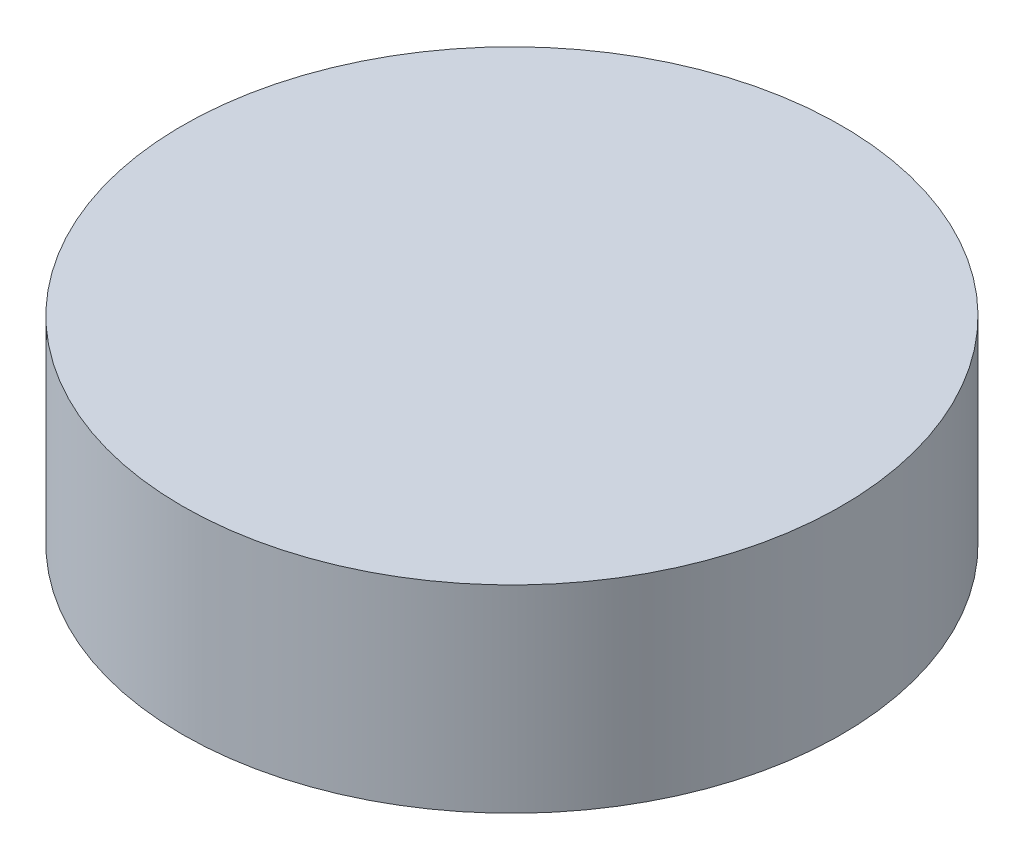
ISO-10303-21;
HEADER;
FILE_DESCRIPTION(('STEP AP214'),'2;1');
FILE_NAME('part.step','',(''),(''),'','','');
FILE_SCHEMA(('AUTOMOTIVE_DESIGN { 1 0 10303 214 1 1 1 1 }'));
ENDSEC;
DATA;
#1=APPLICATION_CONTEXT('core data for automotive mechanical design processes');
#2=APPLICATION_PROTOCOL_DEFINITION('international standard','automotive_design',2000,#1);
#3=PRODUCT_CONTEXT('',#1,'mechanical');
#4=PRODUCT('Part','Part','',(#3));
#5=PRODUCT_RELATED_PRODUCT_CATEGORY('part','',(#4));
#6=PRODUCT_DEFINITION_FORMATION('','',#4);
#7=PRODUCT_DEFINITION_CONTEXT('part definition',#1,'design');
#8=PRODUCT_DEFINITION('design','',#6,#7);
#9=PRODUCT_DEFINITION_SHAPE('','',#8);
#10=(LENGTH_UNIT() NAMED_UNIT(*) SI_UNIT(.MILLI.,.METRE.));
#11=(NAMED_UNIT(*) PLANE_ANGLE_UNIT() SI_UNIT($,.RADIAN.));
#12=(NAMED_UNIT(*) SI_UNIT($,.STERADIAN.) SOLID_ANGLE_UNIT());
#13=UNCERTAINTY_MEASURE_WITH_UNIT(LENGTH_MEASURE(1.E-05),#10,'distance_accuracy_value','');
#14=(GEOMETRIC_REPRESENTATION_CONTEXT(3) GLOBAL_UNCERTAINTY_ASSIGNED_CONTEXT((#13)) GLOBAL_UNIT_ASSIGNED_CONTEXT((#10,
#11,#12)) REPRESENTATION_CONTEXT('',''));
#15=CARTESIAN_POINT('',(0.,0.,0.));
#16=DIRECTION('',(0.,0.,1.));
#17=DIRECTION('',(1.,0.,0.));
#18=AXIS2_PLACEMENT_3D('',#15,#16,#17);
#19=CARTESIAN_POINT('',(0.,2.,0.));
#20=DIRECTION('',(0.,-1.,0.));
#21=DIRECTION('',(0.,0.,-1.));
#22=AXIS2_PLACEMENT_3D('',#19,#20,#21);
#23=CYLINDRICAL_SURFACE('',#22,2.5);
#24=CARTESIAN_POINT('',(0.,0.,0.));
#25=DIRECTION('',(0.,1.,0.));
#26=DIRECTION('',(0.,0.,1.));
#27=AXIS2_PLACEMENT_3D('',#24,#25,#26);
#28=CIRCLE('',#27,2.5);
#29=CARTESIAN_POINT('',(0.,0.,2.5));
#30=VERTEX_POINT('',#29);
#31=EDGE_CURVE('E10',#30,#30,#28,.T.);
#32=ORIENTED_EDGE('',*,*,#31,.T.);
#33=EDGE_LOOP('',(#32));
#34=FACE_BOUND('',#33,.T.);
#35=CARTESIAN_POINT('',(0.,1.5,0.));
#36=DIRECTION('',(0.,1.,0.));
#37=DIRECTION('',(0.,0.,1.));
#38=AXIS2_PLACEMENT_3D('',#35,#36,#37);
#39=CIRCLE('',#38,2.5);
#40=CARTESIAN_POINT('',(0.,1.5,2.5));
#41=VERTEX_POINT('',#40);
#42=EDGE_CURVE('E37',#41,#41,#39,.T.);
#43=ORIENTED_EDGE('',*,*,#42,.F.);
#44=EDGE_LOOP('',(#43));
#45=FACE_BOUND('',#44,.T.);
#46=ADVANCED_FACE('F31',(#34,#45),#23,.T.);
#47=CARTESIAN_POINT('',(0.,0.,0.));
#48=DIRECTION('',(0.,1.,0.));
#49=DIRECTION('',(0.,0.,1.));
#50=AXIS2_PLACEMENT_3D('',#47,#48,#49);
#51=PLANE('',#50);
#52=ORIENTED_EDGE('',*,*,#31,.F.);
#53=EDGE_LOOP('',(#52));
#54=FACE_BOUND('',#53,.T.);
#55=ADVANCED_FACE('F46',(#54),#51,.F.);
#56=CARTESIAN_POINT('',(0.,1.5,0.));
#57=DIRECTION('',(0.,1.,0.));
#58=DIRECTION('',(0.,0.,1.));
#59=AXIS2_PLACEMENT_3D('',#56,#57,#58);
#60=PLANE('',#59);
#61=ORIENTED_EDGE('',*,*,#42,.T.);
#62=EDGE_LOOP('',(#61));
#63=FACE_BOUND('',#62,.T.);
#64=ADVANCED_FACE('F43',(#63),#60,.T.);
#65=CLOSED_SHELL('',(#46,#55,#64));
#66=MANIFOLD_SOLID_BREP('B2',#65);
#67=ADVANCED_BREP_SHAPE_REPRESENTATION('',(#18,#66),#14);
#68=SHAPE_DEFINITION_REPRESENTATION(#9,#67);
ENDSEC;
END-ISO-10303-21;
